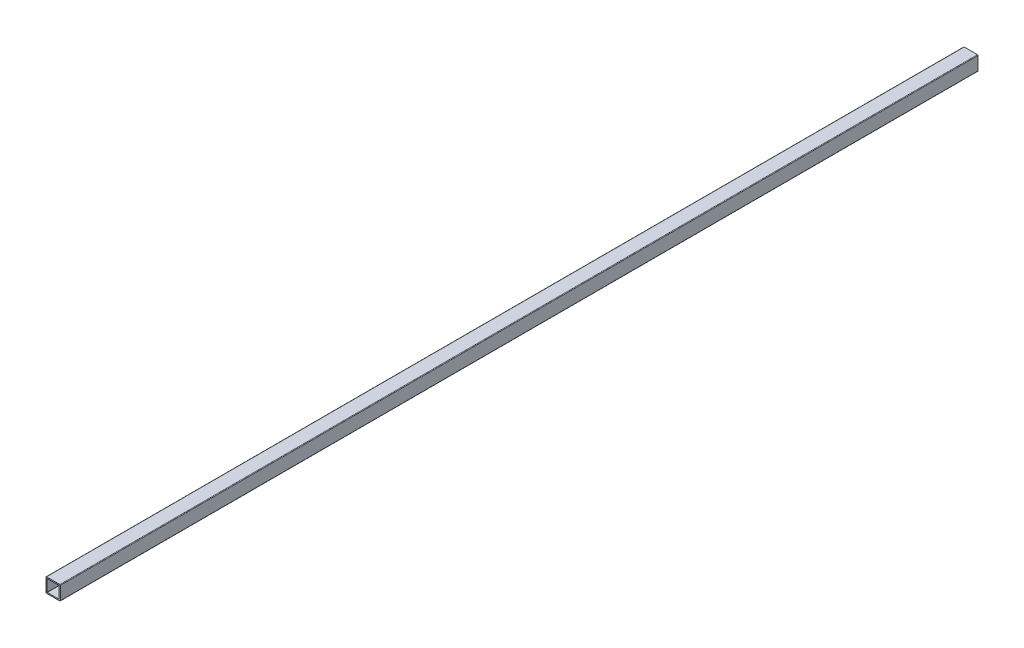
ISO-10303-21;
HEADER;
FILE_DESCRIPTION(('STEP AP214'),'2;1');
FILE_NAME('part.step','',(''),(''),'','','');
FILE_SCHEMA(('AUTOMOTIVE_DESIGN { 1 0 10303 214 1 1 1 1 }'));
ENDSEC;
DATA;
#1=APPLICATION_CONTEXT('core data for automotive mechanical design processes');
#2=APPLICATION_PROTOCOL_DEFINITION('international standard','automotive_design',2000,#1);
#3=PRODUCT_CONTEXT('',#1,'mechanical');
#4=PRODUCT('Part','Part','',(#3));
#5=PRODUCT_RELATED_PRODUCT_CATEGORY('part','',(#4));
#6=PRODUCT_DEFINITION_FORMATION('','',#4);
#7=PRODUCT_DEFINITION_CONTEXT('part definition',#1,'design');
#8=PRODUCT_DEFINITION('design','',#6,#7);
#9=PRODUCT_DEFINITION_SHAPE('','',#8);
#10=(LENGTH_UNIT() NAMED_UNIT(*) SI_UNIT(.MILLI.,.METRE.));
#11=(NAMED_UNIT(*) PLANE_ANGLE_UNIT() SI_UNIT($,.RADIAN.));
#12=(NAMED_UNIT(*) SI_UNIT($,.STERADIAN.) SOLID_ANGLE_UNIT());
#13=UNCERTAINTY_MEASURE_WITH_UNIT(LENGTH_MEASURE(1.E-05),#10,'distance_accuracy_value','');
#14=(GEOMETRIC_REPRESENTATION_CONTEXT(3) GLOBAL_UNCERTAINTY_ASSIGNED_CONTEXT((#13)) GLOBAL_UNIT_ASSIGNED_CONTEXT((#10,
#11,#12)) REPRESENTATION_CONTEXT('',''));
#15=CARTESIAN_POINT('',(0.,0.,0.));
#16=DIRECTION('',(0.,0.,1.));
#17=DIRECTION('',(1.,0.,0.));
#18=AXIS2_PLACEMENT_3D('',#15,#16,#17);
#19=CARTESIAN_POINT('',(0.,0.,1219.2));
#20=DIRECTION('',(0.,0.,1.));
#21=DIRECTION('',(1.,0.,0.));
#22=AXIS2_PLACEMENT_3D('',#19,#20,#21);
#23=PLANE('',#22);
#24=DIRECTION('',(0.,-1.,0.));
#25=VECTOR('',#24,1.);
#26=CARTESIAN_POINT('',(-19.05,-19.05,1219.2));
#27=LINE('',#26,#25);
#28=CARTESIAN_POINT('',(-19.05,17.526,1219.2));
#29=VERTEX_POINT('',#28);
#30=CARTESIAN_POINT('',(-19.05,-17.526,1219.2));
#31=VERTEX_POINT('',#30);
#32=EDGE_CURVE('E207',#29,#31,#27,.T.);
#33=ORIENTED_EDGE('',*,*,#32,.T.);
#34=CARTESIAN_POINT('',(-17.526,-17.526,1219.2));
#35=DIRECTION('',(0.,0.,1.));
#36=DIRECTION('',(1.,0.,0.));
#37=AXIS2_PLACEMENT_3D('',#34,#35,#36);
#38=CIRCLE('',#37,1.524);
#39=CARTESIAN_POINT('',(-17.526,-19.05,1219.2));
#40=VERTEX_POINT('',#39);
#41=EDGE_CURVE('E224',#31,#40,#38,.T.);
#42=ORIENTED_EDGE('',*,*,#41,.T.);
#43=DIRECTION('',(1.,0.,0.));
#44=VECTOR('',#43,1.);
#45=CARTESIAN_POINT('',(-19.05,-19.05,1219.2));
#46=LINE('',#45,#44);
#47=CARTESIAN_POINT('',(17.526,-19.05,1219.2));
#48=VERTEX_POINT('',#47);
#49=EDGE_CURVE('E168',#40,#48,#46,.T.);
#50=ORIENTED_EDGE('',*,*,#49,.T.);
#51=CARTESIAN_POINT('',(17.526,-17.526,1219.2));
#52=DIRECTION('',(0.,0.,1.));
#53=DIRECTION('',(1.,0.,0.));
#54=AXIS2_PLACEMENT_3D('',#51,#52,#53);
#55=CIRCLE('',#54,1.524);
#56=CARTESIAN_POINT('',(19.05,-17.526,1219.2));
#57=VERTEX_POINT('',#56);
#58=EDGE_CURVE('E222',#48,#57,#55,.T.);
#59=ORIENTED_EDGE('',*,*,#58,.T.);
#60=DIRECTION('',(0.,1.,0.));
#61=VECTOR('',#60,1.);
#62=CARTESIAN_POINT('',(19.05,-19.05,1219.2));
#63=LINE('',#62,#61);
#64=CARTESIAN_POINT('',(19.05,17.526,1219.2));
#65=VERTEX_POINT('',#64);
#66=EDGE_CURVE('E201',#57,#65,#63,.T.);
#67=ORIENTED_EDGE('',*,*,#66,.T.);
#68=CARTESIAN_POINT('',(17.526,17.526,1219.2));
#69=DIRECTION('',(0.,0.,1.));
#70=DIRECTION('',(1.,0.,0.));
#71=AXIS2_PLACEMENT_3D('',#68,#69,#70);
#72=CIRCLE('',#71,1.524);
#73=CARTESIAN_POINT('',(17.526,19.05,1219.2));
#74=VERTEX_POINT('',#73);
#75=EDGE_CURVE('E218',#65,#74,#72,.T.);
#76=ORIENTED_EDGE('',*,*,#75,.T.);
#77=DIRECTION('',(-1.,0.,0.));
#78=VECTOR('',#77,1.);
#79=CARTESIAN_POINT('',(-19.05,19.05,1219.2));
#80=LINE('',#79,#78);
#81=CARTESIAN_POINT('',(-17.526,19.05,1219.2));
#82=VERTEX_POINT('',#81);
#83=EDGE_CURVE('E204',#74,#82,#80,.T.);
#84=ORIENTED_EDGE('',*,*,#83,.T.);
#85=CARTESIAN_POINT('',(-17.526,17.526,1219.2));
#86=DIRECTION('',(0.,0.,1.));
#87=DIRECTION('',(1.,0.,0.));
#88=AXIS2_PLACEMENT_3D('',#85,#86,#87);
#89=CIRCLE('',#88,1.524);
#90=EDGE_CURVE('E220',#82,#29,#89,.T.);
#91=ORIENTED_EDGE('',*,*,#90,.T.);
#92=EDGE_LOOP('',(#33,#42,#50,#59,#67,#76,#84,#91));
#93=FACE_BOUND('',#92,.T.);
#94=DIRECTION('',(0.,1.,0.));
#95=VECTOR('',#94,1.);
#96=CARTESIAN_POINT('',(16.002,-16.002,1219.2));
#97=LINE('',#96,#95);
#98=CARTESIAN_POINT('',(16.002,-15.6972,1219.2));
#99=VERTEX_POINT('',#98);
#100=CARTESIAN_POINT('',(16.002,15.6972,1219.2));
#101=VERTEX_POINT('',#100);
#102=EDGE_CURVE('E191',#99,#101,#97,.T.);
#103=ORIENTED_EDGE('',*,*,#102,.F.);
#104=CARTESIAN_POINT('',(15.6972,-15.6972,1219.2));
#105=DIRECTION('',(0.,0.,1.));
#106=DIRECTION('',(1.,0.,0.));
#107=AXIS2_PLACEMENT_3D('',#104,#105,#106);
#108=CIRCLE('',#107,0.3048);
#109=CARTESIAN_POINT('',(15.6972,-16.002,1219.2));
#110=VERTEX_POINT('',#109);
#111=EDGE_CURVE('E49',#99,#110,#108,.F.);
#112=ORIENTED_EDGE('',*,*,#111,.T.);
#113=DIRECTION('',(1.,0.,0.));
#114=VECTOR('',#113,1.);
#115=CARTESIAN_POINT('',(-16.002,-16.002,1219.2));
#116=LINE('',#115,#114);
#117=CARTESIAN_POINT('',(-15.6972,-16.002,1219.2));
#118=VERTEX_POINT('',#117);
#119=EDGE_CURVE('E189',#118,#110,#116,.T.);
#120=ORIENTED_EDGE('',*,*,#119,.F.);
#121=CARTESIAN_POINT('',(-15.6972,-15.6972,1219.2));
#122=DIRECTION('',(0.,0.,1.));
#123=DIRECTION('',(1.,0.,0.));
#124=AXIS2_PLACEMENT_3D('',#121,#122,#123);
#125=CIRCLE('',#124,0.3048);
#126=CARTESIAN_POINT('',(-16.002,-15.6972,1219.2));
#127=VERTEX_POINT('',#126);
#128=EDGE_CURVE('E11',#118,#127,#125,.F.);
#129=ORIENTED_EDGE('',*,*,#128,.T.);
#130=DIRECTION('',(0.,-1.,0.));
#131=VECTOR('',#130,1.);
#132=CARTESIAN_POINT('',(-16.002,-16.002,1219.2));
#133=LINE('',#132,#131);
#134=CARTESIAN_POINT('',(-16.002,15.6972,1219.2));
#135=VERTEX_POINT('',#134);
#136=EDGE_CURVE('E197',#135,#127,#133,.T.);
#137=ORIENTED_EDGE('',*,*,#136,.F.);
#138=CARTESIAN_POINT('',(-15.6972,15.6972,1219.2));
#139=DIRECTION('',(0.,0.,1.));
#140=DIRECTION('',(1.,0.,0.));
#141=AXIS2_PLACEMENT_3D('',#138,#139,#140);
#142=CIRCLE('',#141,0.3048);
#143=CARTESIAN_POINT('',(-15.6972,16.002,1219.2));
#144=VERTEX_POINT('',#143);
#145=EDGE_CURVE('E261',#135,#144,#142,.F.);
#146=ORIENTED_EDGE('',*,*,#145,.T.);
#147=DIRECTION('',(-1.,0.,0.));
#148=VECTOR('',#147,1.);
#149=CARTESIAN_POINT('',(-16.002,16.002,1219.2));
#150=LINE('',#149,#148);
#151=CARTESIAN_POINT('',(15.6972,16.002,1219.2));
#152=VERTEX_POINT('',#151);
#153=EDGE_CURVE('E194',#152,#144,#150,.T.);
#154=ORIENTED_EDGE('',*,*,#153,.F.);
#155=CARTESIAN_POINT('',(15.6972,15.6972,1219.2));
#156=DIRECTION('',(0.,0.,1.));
#157=DIRECTION('',(1.,0.,0.));
#158=AXIS2_PLACEMENT_3D('',#155,#156,#157);
#159=CIRCLE('',#158,0.3048);
#160=EDGE_CURVE('E257',#152,#101,#159,.F.);
#161=ORIENTED_EDGE('',*,*,#160,.T.);
#162=EDGE_LOOP('',(#103,#112,#120,#129,#137,#146,#154,#161));
#163=FACE_BOUND('',#162,.T.);
#164=ADVANCED_FACE('F34',(#93,#163),#23,.T.);
#165=CARTESIAN_POINT('',(-19.05,-19.05,1219.2));
#166=DIRECTION('',(0.,1.,0.));
#167=DIRECTION('',(-1.,0.,0.));
#168=AXIS2_PLACEMENT_3D('',#165,#166,#167);
#169=PLANE('',#168);
#170=ORIENTED_EDGE('',*,*,#49,.F.);
#171=DIRECTION('',(0.,0.,-1.));
#172=VECTOR('',#171,1.);
#173=CARTESIAN_POINT('',(-17.526,-19.05,1219.2));
#174=LINE('',#173,#172);
#175=CARTESIAN_POINT('',(-17.526,-19.05,-1219.2));
#176=VERTEX_POINT('',#175);
#177=EDGE_CURVE('E152',#40,#176,#174,.T.);
#178=ORIENTED_EDGE('',*,*,#177,.T.);
#179=DIRECTION('',(1.,0.,0.));
#180=VECTOR('',#179,1.);
#181=CARTESIAN_POINT('',(-19.05,-19.05,-1219.2));
#182=LINE('',#181,#180);
#183=CARTESIAN_POINT('',(17.526,-19.05,-1219.2));
#184=VERTEX_POINT('',#183);
#185=EDGE_CURVE('E165',#176,#184,#182,.T.);
#186=ORIENTED_EDGE('',*,*,#185,.T.);
#187=DIRECTION('',(0.,0.,-1.));
#188=VECTOR('',#187,1.);
#189=CARTESIAN_POINT('',(17.526,-19.05,1219.2));
#190=LINE('',#189,#188);
#191=EDGE_CURVE('E170',#184,#48,#190,.F.);
#192=ORIENTED_EDGE('',*,*,#191,.T.);
#193=EDGE_LOOP('',(#170,#178,#186,#192));
#194=FACE_BOUND('',#193,.T.);
#195=ADVANCED_FACE('F164',(#194),#169,.F.);
#196=CARTESIAN_POINT('',(19.05,-19.05,1219.2));
#197=DIRECTION('',(-1.,0.,0.));
#198=DIRECTION('',(0.,0.,1.));
#199=AXIS2_PLACEMENT_3D('',#196,#197,#198);
#200=PLANE('',#199);
#201=ORIENTED_EDGE('',*,*,#66,.F.);
#202=DIRECTION('',(0.,0.,-1.));
#203=VECTOR('',#202,1.);
#204=CARTESIAN_POINT('',(19.05,-17.526,1219.2));
#205=LINE('',#204,#203);
#206=CARTESIAN_POINT('',(19.05,-17.526,-1219.2));
#207=VERTEX_POINT('',#206);
#208=EDGE_CURVE('E228',#57,#207,#205,.T.);
#209=ORIENTED_EDGE('',*,*,#208,.T.);
#210=DIRECTION('',(0.,1.,0.));
#211=VECTOR('',#210,1.);
#212=CARTESIAN_POINT('',(19.05,-19.05,-1219.2));
#213=LINE('',#212,#211);
#214=CARTESIAN_POINT('',(19.05,17.526,-1219.2));
#215=VERTEX_POINT('',#214);
#216=EDGE_CURVE('E174',#207,#215,#213,.T.);
#217=ORIENTED_EDGE('',*,*,#216,.T.);
#218=DIRECTION('',(0.,0.,-1.));
#219=VECTOR('',#218,1.);
#220=CARTESIAN_POINT('',(19.05,17.526,1219.2));
#221=LINE('',#220,#219);
#222=EDGE_CURVE('E226',#215,#65,#221,.F.);
#223=ORIENTED_EDGE('',*,*,#222,.T.);
#224=EDGE_LOOP('',(#201,#209,#217,#223));
#225=FACE_BOUND('',#224,.T.);
#226=ADVANCED_FACE('F314',(#225),#200,.F.);
#227=CARTESIAN_POINT('',(-19.05,19.05,1219.2));
#228=DIRECTION('',(0.,-1.,0.));
#229=DIRECTION('',(0.,0.,-1.));
#230=AXIS2_PLACEMENT_3D('',#227,#228,#229);
#231=PLANE('',#230);
#232=DIRECTION('',(-1.,0.,0.));
#233=VECTOR('',#232,1.);
#234=CARTESIAN_POINT('',(-19.05,19.05,-1219.2));
#235=LINE('',#234,#233);
#236=CARTESIAN_POINT('',(17.526,19.05,-1219.2));
#237=VERTEX_POINT('',#236);
#238=CARTESIAN_POINT('',(-17.526,19.05,-1219.2));
#239=VERTEX_POINT('',#238);
#240=EDGE_CURVE('E178',#237,#239,#235,.T.);
#241=ORIENTED_EDGE('',*,*,#240,.T.);
#242=DIRECTION('',(0.,0.,-1.));
#243=VECTOR('',#242,1.);
#244=CARTESIAN_POINT('',(-17.526,19.05,1219.2));
#245=LINE('',#244,#243);
#246=EDGE_CURVE('E234',#239,#82,#245,.F.);
#247=ORIENTED_EDGE('',*,*,#246,.T.);
#248=ORIENTED_EDGE('',*,*,#83,.F.);
#249=DIRECTION('',(0.,0.,-1.));
#250=VECTOR('',#249,1.);
#251=CARTESIAN_POINT('',(17.526,19.05,1219.2));
#252=LINE('',#251,#250);
#253=EDGE_CURVE('E231',#74,#237,#252,.T.);
#254=ORIENTED_EDGE('',*,*,#253,.T.);
#255=EDGE_LOOP('',(#241,#247,#248,#254));
#256=FACE_BOUND('',#255,.T.);
#257=ADVANCED_FACE('F322',(#256),#231,.F.);
#258=CARTESIAN_POINT('',(-19.05,-19.05,1219.2));
#259=DIRECTION('',(1.,0.,0.));
#260=DIRECTION('',(0.,0.,-1.));
#261=AXIS2_PLACEMENT_3D('',#258,#259,#260);
#262=PLANE('',#261);
#263=DIRECTION('',(0.,-1.,0.));
#264=VECTOR('',#263,1.);
#265=CARTESIAN_POINT('',(-19.05,-19.05,-1219.2));
#266=LINE('',#265,#264);
#267=CARTESIAN_POINT('',(-19.05,17.526,-1219.2));
#268=VERTEX_POINT('',#267);
#269=CARTESIAN_POINT('',(-19.05,-17.526,-1219.2));
#270=VERTEX_POINT('',#269);
#271=EDGE_CURVE('E187',#268,#270,#266,.T.);
#272=ORIENTED_EDGE('',*,*,#271,.T.);
#273=DIRECTION('',(0.,0.,-1.));
#274=VECTOR('',#273,1.);
#275=CARTESIAN_POINT('',(-19.05,-17.526,1219.2));
#276=LINE('',#275,#274);
#277=EDGE_CURVE('E153',#270,#31,#276,.F.);
#278=ORIENTED_EDGE('',*,*,#277,.T.);
#279=ORIENTED_EDGE('',*,*,#32,.F.);
#280=DIRECTION('',(0.,0.,-1.));
#281=VECTOR('',#280,1.);
#282=CARTESIAN_POINT('',(-19.05,17.526,1219.2));
#283=LINE('',#282,#281);
#284=EDGE_CURVE('E158',#29,#268,#283,.T.);
#285=ORIENTED_EDGE('',*,*,#284,.T.);
#286=EDGE_LOOP('',(#272,#278,#279,#285));
#287=FACE_BOUND('',#286,.T.);
#288=ADVANCED_FACE('F319',(#287),#262,.F.);
#289=CARTESIAN_POINT('',(-16.002,-16.002,1219.2));
#290=DIRECTION('',(0.,1.,0.));
#291=DIRECTION('',(-1.,0.,0.));
#292=AXIS2_PLACEMENT_3D('',#289,#290,#291);
#293=PLANE('',#292);
#294=ORIENTED_EDGE('',*,*,#119,.T.);
#295=DIRECTION('',(0.,0.,-1.));
#296=VECTOR('',#295,1.);
#297=CARTESIAN_POINT('',(15.6972,-16.002,-1219.2));
#298=LINE('',#297,#296);
#299=CARTESIAN_POINT('',(15.6972,-16.002,-1219.2));
#300=VERTEX_POINT('',#299);
#301=EDGE_CURVE('E252',#110,#300,#298,.T.);
#302=ORIENTED_EDGE('',*,*,#301,.T.);
#303=DIRECTION('',(1.,0.,0.));
#304=VECTOR('',#303,1.);
#305=CARTESIAN_POINT('',(-16.002,-16.002,-1219.2));
#306=LINE('',#305,#304);
#307=CARTESIAN_POINT('',(-15.6972,-16.002,-1219.2));
#308=VERTEX_POINT('',#307);
#309=EDGE_CURVE('E268',#308,#300,#306,.T.);
#310=ORIENTED_EDGE('',*,*,#309,.F.);
#311=DIRECTION('',(0.,0.,-1.));
#312=VECTOR('',#311,1.);
#313=CARTESIAN_POINT('',(-15.6972,-16.002,1219.2));
#314=LINE('',#313,#312);
#315=EDGE_CURVE('E56',#308,#118,#314,.F.);
#316=ORIENTED_EDGE('',*,*,#315,.T.);
#317=EDGE_LOOP('',(#294,#302,#310,#316));
#318=FACE_BOUND('',#317,.T.);
#319=ADVANCED_FACE('F272',(#318),#293,.T.);
#320=CARTESIAN_POINT('',(16.002,-16.002,1219.2));
#321=DIRECTION('',(-1.,0.,0.));
#322=DIRECTION('',(0.,0.,1.));
#323=AXIS2_PLACEMENT_3D('',#320,#321,#322);
#324=PLANE('',#323);
#325=ORIENTED_EDGE('',*,*,#102,.T.);
#326=DIRECTION('',(0.,0.,-1.));
#327=VECTOR('',#326,1.);
#328=CARTESIAN_POINT('',(16.002,15.6972,-1219.2));
#329=LINE('',#328,#327);
#330=CARTESIAN_POINT('',(16.002,15.6972,-1219.2));
#331=VERTEX_POINT('',#330);
#332=EDGE_CURVE('E238',#101,#331,#329,.T.);
#333=ORIENTED_EDGE('',*,*,#332,.T.);
#334=DIRECTION('',(0.,1.,0.));
#335=VECTOR('',#334,1.);
#336=CARTESIAN_POINT('',(16.002,-16.002,-1219.2));
#337=LINE('',#336,#335);
#338=CARTESIAN_POINT('',(16.002,-15.6972,-1219.2));
#339=VERTEX_POINT('',#338);
#340=EDGE_CURVE('E274',#339,#331,#337,.T.);
#341=ORIENTED_EDGE('',*,*,#340,.F.);
#342=DIRECTION('',(0.,0.,-1.));
#343=VECTOR('',#342,1.);
#344=CARTESIAN_POINT('',(16.002,-15.6972,1219.2));
#345=LINE('',#344,#343);
#346=EDGE_CURVE('E236',#339,#99,#345,.F.);
#347=ORIENTED_EDGE('',*,*,#346,.T.);
#348=EDGE_LOOP('',(#325,#333,#341,#347));
#349=FACE_BOUND('',#348,.T.);
#350=ADVANCED_FACE('F295',(#349),#324,.T.);
#351=CARTESIAN_POINT('',(-16.002,16.002,1219.2));
#352=DIRECTION('',(0.,-1.,0.));
#353=DIRECTION('',(1.,0.,0.));
#354=AXIS2_PLACEMENT_3D('',#351,#352,#353);
#355=PLANE('',#354);
#356=DIRECTION('',(-1.,0.,0.));
#357=VECTOR('',#356,1.);
#358=CARTESIAN_POINT('',(-16.002,16.002,-1219.2));
#359=LINE('',#358,#357);
#360=CARTESIAN_POINT('',(15.6972,16.002,-1219.2));
#361=VERTEX_POINT('',#360);
#362=CARTESIAN_POINT('',(-15.6972,16.002,-1219.2));
#363=VERTEX_POINT('',#362);
#364=EDGE_CURVE('E181',#361,#363,#359,.T.);
#365=ORIENTED_EDGE('',*,*,#364,.F.);
#366=DIRECTION('',(0.,0.,-1.));
#367=VECTOR('',#366,1.);
#368=CARTESIAN_POINT('',(15.6972,16.002,1219.2));
#369=LINE('',#368,#367);
#370=EDGE_CURVE('E244',#361,#152,#369,.F.);
#371=ORIENTED_EDGE('',*,*,#370,.T.);
#372=ORIENTED_EDGE('',*,*,#153,.T.);
#373=DIRECTION('',(0.,0.,-1.));
#374=VECTOR('',#373,1.);
#375=CARTESIAN_POINT('',(-15.6972,16.002,-1219.2));
#376=LINE('',#375,#374);
#377=EDGE_CURVE('E241',#144,#363,#376,.T.);
#378=ORIENTED_EDGE('',*,*,#377,.T.);
#379=EDGE_LOOP('',(#365,#371,#372,#378));
#380=FACE_BOUND('',#379,.T.);
#381=ADVANCED_FACE('F289',(#380),#355,.T.);
#382=CARTESIAN_POINT('',(-16.002,-16.002,1219.2));
#383=DIRECTION('',(1.,0.,0.));
#384=DIRECTION('',(0.,0.,-1.));
#385=AXIS2_PLACEMENT_3D('',#382,#383,#384);
#386=PLANE('',#385);
#387=DIRECTION('',(0.,-1.,0.));
#388=VECTOR('',#387,1.);
#389=CARTESIAN_POINT('',(-16.002,-16.002,-1219.2));
#390=LINE('',#389,#388);
#391=CARTESIAN_POINT('',(-16.002,15.6972,-1219.2));
#392=VERTEX_POINT('',#391);
#393=CARTESIAN_POINT('',(-16.002,-15.6972,-1219.2));
#394=VERTEX_POINT('',#393);
#395=EDGE_CURVE('E175',#392,#394,#390,.T.);
#396=ORIENTED_EDGE('',*,*,#395,.F.);
#397=DIRECTION('',(0.,0.,-1.));
#398=VECTOR('',#397,1.);
#399=CARTESIAN_POINT('',(-16.002,15.6972,1219.2));
#400=LINE('',#399,#398);
#401=EDGE_CURVE('E249',#392,#135,#400,.F.);
#402=ORIENTED_EDGE('',*,*,#401,.T.);
#403=ORIENTED_EDGE('',*,*,#136,.T.);
#404=DIRECTION('',(0.,0.,-1.));
#405=VECTOR('',#404,1.);
#406=CARTESIAN_POINT('',(-16.002,-15.6972,-1219.2));
#407=LINE('',#406,#405);
#408=EDGE_CURVE('E246',#127,#394,#407,.T.);
#409=ORIENTED_EDGE('',*,*,#408,.T.);
#410=EDGE_LOOP('',(#396,#402,#403,#409));
#411=FACE_BOUND('',#410,.T.);
#412=ADVANCED_FACE('F280',(#411),#386,.T.);
#413=CARTESIAN_POINT('',(0.,0.,-1219.2));
#414=DIRECTION('',(0.,0.,1.));
#415=DIRECTION('',(1.,0.,0.));
#416=AXIS2_PLACEMENT_3D('',#413,#414,#415);
#417=PLANE('',#416);
#418=ORIENTED_EDGE('',*,*,#364,.T.);
#419=CARTESIAN_POINT('',(-15.6972,15.6972,-1219.2));
#420=DIRECTION('',(0.,0.,1.));
#421=DIRECTION('',(1.,0.,0.));
#422=AXIS2_PLACEMENT_3D('',#419,#420,#421);
#423=CIRCLE('',#422,0.3048);
#424=EDGE_CURVE('E259',#363,#392,#423,.T.);
#425=ORIENTED_EDGE('',*,*,#424,.T.);
#426=ORIENTED_EDGE('',*,*,#395,.T.);
#427=CARTESIAN_POINT('',(-15.6972,-15.6972,-1219.2));
#428=DIRECTION('',(0.,0.,1.));
#429=DIRECTION('',(1.,0.,0.));
#430=AXIS2_PLACEMENT_3D('',#427,#428,#429);
#431=CIRCLE('',#430,0.3048);
#432=EDGE_CURVE('E42',#394,#308,#431,.T.);
#433=ORIENTED_EDGE('',*,*,#432,.T.);
#434=ORIENTED_EDGE('',*,*,#309,.T.);
#435=CARTESIAN_POINT('',(15.6972,-15.6972,-1219.2));
#436=DIRECTION('',(0.,0.,1.));
#437=DIRECTION('',(1.,0.,0.));
#438=AXIS2_PLACEMENT_3D('',#435,#436,#437);
#439=CIRCLE('',#438,0.3048);
#440=EDGE_CURVE('E263',#300,#339,#439,.T.);
#441=ORIENTED_EDGE('',*,*,#440,.T.);
#442=ORIENTED_EDGE('',*,*,#340,.T.);
#443=CARTESIAN_POINT('',(15.6972,15.6972,-1219.2));
#444=DIRECTION('',(0.,0.,1.));
#445=DIRECTION('',(1.,0.,0.));
#446=AXIS2_PLACEMENT_3D('',#443,#444,#445);
#447=CIRCLE('',#446,0.3048);
#448=EDGE_CURVE('E255',#331,#361,#447,.T.);
#449=ORIENTED_EDGE('',*,*,#448,.T.);
#450=EDGE_LOOP('',(#418,#425,#426,#433,#434,#441,#442,#449));
#451=FACE_BOUND('',#450,.T.);
#452=ORIENTED_EDGE('',*,*,#185,.F.);
#453=CARTESIAN_POINT('',(-17.526,-17.526,-1219.2));
#454=DIRECTION('',(0.,0.,1.));
#455=DIRECTION('',(1.,0.,0.));
#456=AXIS2_PLACEMENT_3D('',#453,#454,#455);
#457=CIRCLE('',#456,1.524);
#458=EDGE_CURVE('E148',#176,#270,#457,.F.);
#459=ORIENTED_EDGE('',*,*,#458,.T.);
#460=ORIENTED_EDGE('',*,*,#271,.F.);
#461=CARTESIAN_POINT('',(-17.526,17.526,-1219.2));
#462=DIRECTION('',(0.,0.,1.));
#463=DIRECTION('',(1.,0.,0.));
#464=AXIS2_PLACEMENT_3D('',#461,#462,#463);
#465=CIRCLE('',#464,1.524);
#466=EDGE_CURVE('E212',#268,#239,#465,.F.);
#467=ORIENTED_EDGE('',*,*,#466,.T.);
#468=ORIENTED_EDGE('',*,*,#240,.F.);
#469=CARTESIAN_POINT('',(17.526,17.526,-1219.2));
#470=DIRECTION('',(0.,0.,1.));
#471=DIRECTION('',(1.,0.,0.));
#472=AXIS2_PLACEMENT_3D('',#469,#470,#471);
#473=CIRCLE('',#472,1.524);
#474=EDGE_CURVE('E169',#237,#215,#473,.F.);
#475=ORIENTED_EDGE('',*,*,#474,.T.);
#476=ORIENTED_EDGE('',*,*,#216,.F.);
#477=CARTESIAN_POINT('',(17.526,-17.526,-1219.2));
#478=DIRECTION('',(0.,0.,1.));
#479=DIRECTION('',(1.,0.,0.));
#480=AXIS2_PLACEMENT_3D('',#477,#478,#479);
#481=CIRCLE('',#480,1.524);
#482=EDGE_CURVE('E159',#207,#184,#481,.F.);
#483=ORIENTED_EDGE('',*,*,#482,.T.);
#484=EDGE_LOOP('',(#452,#459,#460,#467,#468,#475,#476,#483));
#485=FACE_BOUND('',#484,.T.);
#486=ADVANCED_FACE('F172',(#451,#485),#417,.F.);
#487=CARTESIAN_POINT('',(-17.526,-17.526,1219.2));
#488=DIRECTION('',(0.,0.,-1.));
#489=DIRECTION('',(-1.,0.,0.));
#490=AXIS2_PLACEMENT_3D('',#487,#488,#489);
#491=CYLINDRICAL_SURFACE('',#490,1.524);
#492=ORIENTED_EDGE('',*,*,#41,.F.);
#493=ORIENTED_EDGE('',*,*,#277,.F.);
#494=ORIENTED_EDGE('',*,*,#458,.F.);
#495=ORIENTED_EDGE('',*,*,#177,.F.);
#496=EDGE_LOOP('',(#492,#493,#494,#495));
#497=FACE_BOUND('',#496,.T.);
#498=ADVANCED_FACE('F151',(#497),#491,.T.);
#499=CARTESIAN_POINT('',(17.526,-17.526,1219.2));
#500=DIRECTION('',(0.,0.,-1.));
#501=DIRECTION('',(-1.,0.,0.));
#502=AXIS2_PLACEMENT_3D('',#499,#500,#501);
#503=CYLINDRICAL_SURFACE('',#502,1.524);
#504=ORIENTED_EDGE('',*,*,#58,.F.);
#505=ORIENTED_EDGE('',*,*,#191,.F.);
#506=ORIENTED_EDGE('',*,*,#482,.F.);
#507=ORIENTED_EDGE('',*,*,#208,.F.);
#508=EDGE_LOOP('',(#504,#505,#506,#507));
#509=FACE_BOUND('',#508,.T.);
#510=ADVANCED_FACE('F332',(#509),#503,.T.);
#511=CARTESIAN_POINT('',(-17.526,17.526,1219.2));
#512=DIRECTION('',(0.,0.,-1.));
#513=DIRECTION('',(-1.,0.,0.));
#514=AXIS2_PLACEMENT_3D('',#511,#512,#513);
#515=CYLINDRICAL_SURFACE('',#514,1.524);
#516=ORIENTED_EDGE('',*,*,#90,.F.);
#517=ORIENTED_EDGE('',*,*,#246,.F.);
#518=ORIENTED_EDGE('',*,*,#466,.F.);
#519=ORIENTED_EDGE('',*,*,#284,.F.);
#520=EDGE_LOOP('',(#516,#517,#518,#519));
#521=FACE_BOUND('',#520,.T.);
#522=ADVANCED_FACE('F335',(#521),#515,.T.);
#523=CARTESIAN_POINT('',(17.526,17.526,1219.2));
#524=DIRECTION('',(0.,0.,-1.));
#525=DIRECTION('',(-1.,0.,0.));
#526=AXIS2_PLACEMENT_3D('',#523,#524,#525);
#527=CYLINDRICAL_SURFACE('',#526,1.524);
#528=ORIENTED_EDGE('',*,*,#75,.F.);
#529=ORIENTED_EDGE('',*,*,#222,.F.);
#530=ORIENTED_EDGE('',*,*,#474,.F.);
#531=ORIENTED_EDGE('',*,*,#253,.F.);
#532=EDGE_LOOP('',(#528,#529,#530,#531));
#533=FACE_BOUND('',#532,.T.);
#534=ADVANCED_FACE('F339',(#533),#527,.T.);
#535=CARTESIAN_POINT('',(15.6972,15.6972,1219.2));
#536=DIRECTION('',(0.,0.,1.));
#537=DIRECTION('',(1.,0.,0.));
#538=AXIS2_PLACEMENT_3D('',#535,#536,#537);
#539=CYLINDRICAL_SURFACE('',#538,0.3048);
#540=ORIENTED_EDGE('',*,*,#160,.F.);
#541=ORIENTED_EDGE('',*,*,#370,.F.);
#542=ORIENTED_EDGE('',*,*,#448,.F.);
#543=ORIENTED_EDGE('',*,*,#332,.F.);
#544=EDGE_LOOP('',(#540,#541,#542,#543));
#545=FACE_BOUND('',#544,.T.);
#546=ADVANCED_FACE('F292',(#545),#539,.F.);
#547=CARTESIAN_POINT('',(-15.6972,15.6972,1219.2));
#548=DIRECTION('',(0.,0.,1.));
#549=DIRECTION('',(1.,0.,0.));
#550=AXIS2_PLACEMENT_3D('',#547,#548,#549);
#551=CYLINDRICAL_SURFACE('',#550,0.3048);
#552=ORIENTED_EDGE('',*,*,#145,.F.);
#553=ORIENTED_EDGE('',*,*,#401,.F.);
#554=ORIENTED_EDGE('',*,*,#424,.F.);
#555=ORIENTED_EDGE('',*,*,#377,.F.);
#556=EDGE_LOOP('',(#552,#553,#554,#555));
#557=FACE_BOUND('',#556,.T.);
#558=ADVANCED_FACE('F283',(#557),#551,.F.);
#559=CARTESIAN_POINT('',(15.6972,-15.6972,1219.2));
#560=DIRECTION('',(0.,0.,1.));
#561=DIRECTION('',(1.,0.,0.));
#562=AXIS2_PLACEMENT_3D('',#559,#560,#561);
#563=CYLINDRICAL_SURFACE('',#562,0.3048);
#564=ORIENTED_EDGE('',*,*,#111,.F.);
#565=ORIENTED_EDGE('',*,*,#346,.F.);
#566=ORIENTED_EDGE('',*,*,#440,.F.);
#567=ORIENTED_EDGE('',*,*,#301,.F.);
#568=EDGE_LOOP('',(#564,#565,#566,#567));
#569=FACE_BOUND('',#568,.T.);
#570=ADVANCED_FACE('F300',(#569),#563,.F.);
#571=CARTESIAN_POINT('',(-15.6972,-15.6972,1219.2));
#572=DIRECTION('',(0.,0.,1.));
#573=DIRECTION('',(1.,0.,0.));
#574=AXIS2_PLACEMENT_3D('',#571,#572,#573);
#575=CYLINDRICAL_SURFACE('',#574,0.3048);
#576=ORIENTED_EDGE('',*,*,#128,.F.);
#577=ORIENTED_EDGE('',*,*,#315,.F.);
#578=ORIENTED_EDGE('',*,*,#432,.F.);
#579=ORIENTED_EDGE('',*,*,#408,.F.);
#580=EDGE_LOOP('',(#576,#577,#578,#579));
#581=FACE_BOUND('',#580,.T.);
#582=ADVANCED_FACE('F36',(#581),#575,.F.);
#583=CLOSED_SHELL('',(#164,#195,#226,#257,#288,#319,#350,#381,#412,#486,#498,#510,#522,#534,
#546,#558,#570,#582));
#584=MANIFOLD_SOLID_BREP('B2',#583);
#585=ADVANCED_BREP_SHAPE_REPRESENTATION('',(#18,#584),#14);
#586=SHAPE_DEFINITION_REPRESENTATION(#9,#585);
ENDSEC;
END-ISO-10303-21;
